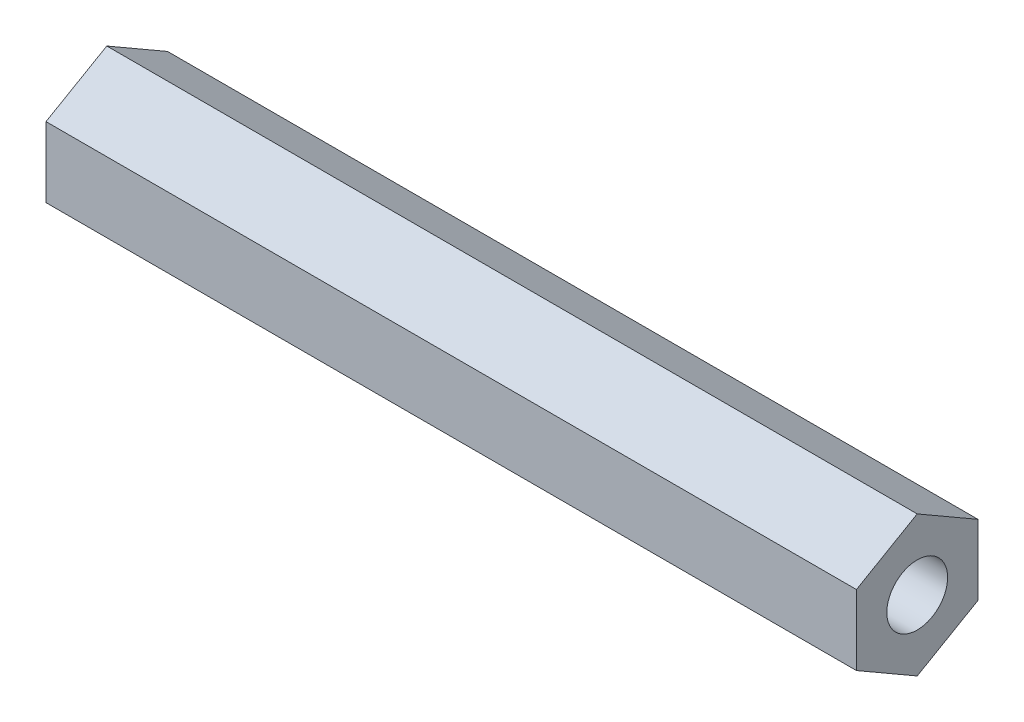
ISO-10303-21;
HEADER;
FILE_DESCRIPTION(('STEP AP214'),'2;1');
FILE_NAME('part.step','',(''),(''),'','','');
FILE_SCHEMA(('AUTOMOTIVE_DESIGN { 1 0 10303 214 1 1 1 1 }'));
ENDSEC;
DATA;
#1=APPLICATION_CONTEXT('core data for automotive mechanical design processes');
#2=APPLICATION_PROTOCOL_DEFINITION('international standard','automotive_design',2000,#1);
#3=PRODUCT_CONTEXT('',#1,'mechanical');
#4=PRODUCT('Part','Part','',(#3));
#5=PRODUCT_RELATED_PRODUCT_CATEGORY('part','',(#4));
#6=PRODUCT_DEFINITION_FORMATION('','',#4);
#7=PRODUCT_DEFINITION_CONTEXT('part definition',#1,'design');
#8=PRODUCT_DEFINITION('design','',#6,#7);
#9=PRODUCT_DEFINITION_SHAPE('','',#8);
#10=(LENGTH_UNIT() NAMED_UNIT(*) SI_UNIT(.MILLI.,.METRE.));
#11=(NAMED_UNIT(*) PLANE_ANGLE_UNIT() SI_UNIT($,.RADIAN.));
#12=(NAMED_UNIT(*) SI_UNIT($,.STERADIAN.) SOLID_ANGLE_UNIT());
#13=UNCERTAINTY_MEASURE_WITH_UNIT(LENGTH_MEASURE(1.E-05),#10,'distance_accuracy_value','');
#14=(GEOMETRIC_REPRESENTATION_CONTEXT(3) GLOBAL_UNCERTAINTY_ASSIGNED_CONTEXT((#13)) GLOBAL_UNIT_ASSIGNED_CONTEXT((#10,
#11,#12)) REPRESENTATION_CONTEXT('',''));
#15=CARTESIAN_POINT('',(0.,0.,0.));
#16=DIRECTION('',(0.,0.,1.));
#17=DIRECTION('',(1.,0.,0.));
#18=AXIS2_PLACEMENT_3D('',#15,#16,#17);
#19=CARTESIAN_POINT('',(40.,0.,0.));
#20=DIRECTION('',(1.,0.,0.));
#21=DIRECTION('',(0.,0.,-1.));
#22=AXIS2_PLACEMENT_3D('',#19,#20,#21);
#23=PLANE('',#22);
#24=DIRECTION('',(0.,0.5,0.866025403784438));
#25=VECTOR('',#24,1.);
#26=CARTESIAN_POINT('',(40.,6.54507984553655,39.7283363635929));
#27=LINE('',#26,#25);
#28=CARTESIAN_POINT('',(40.,6.54507984553655,39.7283363635929));
#29=VERTEX_POINT('',#28);
#30=CARTESIAN_POINT('',(40.,8.27713065310544,42.7283363635929));
#31=VERTEX_POINT('',#30);
#32=EDGE_CURVE('E146',#29,#31,#27,.T.);
#33=ORIENTED_EDGE('',*,*,#32,.T.);
#34=DIRECTION('',(0.,-0.500000000000001,0.866025403784438));
#35=VECTOR('',#34,1.);
#36=CARTESIAN_POINT('',(40.,8.27713065310544,42.7283363635929));
#37=LINE('',#36,#35);
#38=CARTESIAN_POINT('',(40.,6.54507984553656,45.7283363635929));
#39=VERTEX_POINT('',#38);
#40=EDGE_CURVE('E94',#31,#39,#37,.T.);
#41=ORIENTED_EDGE('',*,*,#40,.T.);
#42=DIRECTION('',(0.,-1.,0.));
#43=VECTOR('',#42,1.);
#44=CARTESIAN_POINT('',(40.,6.54507984553656,45.7283363635929));
#45=LINE('',#44,#43);
#46=CARTESIAN_POINT('',(40.,3.08097823039881,45.7283363635929));
#47=VERTEX_POINT('',#46);
#48=EDGE_CURVE('E107',#39,#47,#45,.T.);
#49=ORIENTED_EDGE('',*,*,#48,.T.);
#50=DIRECTION('',(0.,-0.5,-0.866025403784439));
#51=VECTOR('',#50,1.);
#52=CARTESIAN_POINT('',(40.,3.08097823039881,45.7283363635929));
#53=LINE('',#52,#51);
#54=CARTESIAN_POINT('',(40.,1.34892742282993,42.7283363635929));
#55=VERTEX_POINT('',#54);
#56=EDGE_CURVE('E101',#47,#55,#53,.T.);
#57=ORIENTED_EDGE('',*,*,#56,.T.);
#58=DIRECTION('',(0.,0.5,-0.866025403784439));
#59=VECTOR('',#58,1.);
#60=CARTESIAN_POINT('',(40.,1.34892742282993,42.7283363635929));
#61=LINE('',#60,#59);
#62=CARTESIAN_POINT('',(40.,3.0809782303988,39.7283363635929));
#63=VERTEX_POINT('',#62);
#64=EDGE_CURVE('E105',#55,#63,#61,.T.);
#65=ORIENTED_EDGE('',*,*,#64,.T.);
#66=DIRECTION('',(0.,1.,0.));
#67=VECTOR('',#66,1.);
#68=CARTESIAN_POINT('',(40.,3.0809782303988,39.7283363635929));
#69=LINE('',#68,#67);
#70=EDGE_CURVE('E57',#63,#29,#69,.T.);
#71=ORIENTED_EDGE('',*,*,#70,.T.);
#72=EDGE_LOOP('',(#33,#41,#49,#57,#65,#71));
#73=FACE_BOUND('',#72,.T.);
#74=CARTESIAN_POINT('',(40.,4.81302903796769,42.7283363635929));
#75=DIRECTION('',(1.,0.,0.));
#76=DIRECTION('',(0.,0.,-1.));
#77=AXIS2_PLACEMENT_3D('',#74,#75,#76);
#78=CIRCLE('',#77,1.5);
#79=CARTESIAN_POINT('',(40.,4.81302903796769,41.2283363635929));
#80=VERTEX_POINT('',#79);
#81=EDGE_CURVE('E134',#80,#80,#78,.T.);
#82=ORIENTED_EDGE('',*,*,#81,.F.);
#83=EDGE_LOOP('',(#82));
#84=FACE_BOUND('',#83,.T.);
#85=ADVANCED_FACE('F39',(#73,#84),#23,.T.);
#86=CARTESIAN_POINT('',(0.,0.,0.));
#87=DIRECTION('',(1.,0.,0.));
#88=DIRECTION('',(0.,0.,-1.));
#89=AXIS2_PLACEMENT_3D('',#86,#87,#88);
#90=PLANE('',#89);
#91=DIRECTION('',(0.,0.5,0.866025403784438));
#92=VECTOR('',#91,1.);
#93=CARTESIAN_POINT('',(0.,6.54507984553655,39.7283363635929));
#94=LINE('',#93,#92);
#95=CARTESIAN_POINT('',(0.,6.54507984553655,39.7283363635929));
#96=VERTEX_POINT('',#95);
#97=CARTESIAN_POINT('',(0.,8.27713065310544,42.7283363635929));
#98=VERTEX_POINT('',#97);
#99=EDGE_CURVE('E129',#96,#98,#94,.T.);
#100=ORIENTED_EDGE('',*,*,#99,.F.);
#101=DIRECTION('',(0.,1.,0.));
#102=VECTOR('',#101,1.);
#103=CARTESIAN_POINT('',(0.,3.0809782303988,39.7283363635929));
#104=LINE('',#103,#102);
#105=CARTESIAN_POINT('',(0.,3.0809782303988,39.7283363635929));
#106=VERTEX_POINT('',#105);
#107=EDGE_CURVE('E86',#106,#96,#104,.T.);
#108=ORIENTED_EDGE('',*,*,#107,.F.);
#109=DIRECTION('',(0.,0.5,-0.866025403784439));
#110=VECTOR('',#109,1.);
#111=CARTESIAN_POINT('',(0.,1.34892742282993,42.7283363635929));
#112=LINE('',#111,#110);
#113=CARTESIAN_POINT('',(0.,1.34892742282993,42.7283363635929));
#114=VERTEX_POINT('',#113);
#115=EDGE_CURVE('E80',#114,#106,#112,.T.);
#116=ORIENTED_EDGE('',*,*,#115,.F.);
#117=DIRECTION('',(0.,-0.5,-0.866025403784439));
#118=VECTOR('',#117,1.);
#119=CARTESIAN_POINT('',(0.,3.08097823039881,45.7283363635929));
#120=LINE('',#119,#118);
#121=CARTESIAN_POINT('',(0.,3.08097823039881,45.7283363635929));
#122=VERTEX_POINT('',#121);
#123=EDGE_CURVE('E116',#122,#114,#120,.T.);
#124=ORIENTED_EDGE('',*,*,#123,.F.);
#125=DIRECTION('',(0.,-1.,0.));
#126=VECTOR('',#125,1.);
#127=CARTESIAN_POINT('',(0.,6.54507984553656,45.7283363635929));
#128=LINE('',#127,#126);
#129=CARTESIAN_POINT('',(0.,6.54507984553656,45.7283363635929));
#130=VERTEX_POINT('',#129);
#131=EDGE_CURVE('E137',#130,#122,#128,.T.);
#132=ORIENTED_EDGE('',*,*,#131,.F.);
#133=DIRECTION('',(0.,-0.500000000000001,0.866025403784438));
#134=VECTOR('',#133,1.);
#135=CARTESIAN_POINT('',(0.,8.27713065310544,42.7283363635929));
#136=LINE('',#135,#134);
#137=EDGE_CURVE('E133',#98,#130,#136,.T.);
#138=ORIENTED_EDGE('',*,*,#137,.F.);
#139=EDGE_LOOP('',(#100,#108,#116,#124,#132,#138));
#140=FACE_BOUND('',#139,.T.);
#141=CARTESIAN_POINT('',(0.,4.81302903796769,42.7283363635929));
#142=DIRECTION('',(1.,0.,0.));
#143=DIRECTION('',(0.,0.,-1.));
#144=AXIS2_PLACEMENT_3D('',#141,#142,#143);
#145=CIRCLE('',#144,1.5);
#146=CARTESIAN_POINT('',(0.,4.81302903796769,41.2283363635929));
#147=VERTEX_POINT('',#146);
#148=EDGE_CURVE('E243',#147,#147,#145,.T.);
#149=ORIENTED_EDGE('',*,*,#148,.T.);
#150=EDGE_LOOP('',(#149));
#151=FACE_BOUND('',#150,.T.);
#152=ADVANCED_FACE('F159',(#140,#151),#90,.F.);
#153=CARTESIAN_POINT('',(40.,6.54507984553655,39.7283363635929));
#154=DIRECTION('',(0.,-0.866025403784439,0.5));
#155=DIRECTION('',(0.,-0.5,-0.866025403784439));
#156=AXIS2_PLACEMENT_3D('',#153,#154,#155);
#157=PLANE('',#156);
#158=ORIENTED_EDGE('',*,*,#99,.T.);
#159=DIRECTION('',(-1.,0.,0.));
#160=VECTOR('',#159,1.);
#161=CARTESIAN_POINT('',(40.,8.27713065310544,42.7283363635929));
#162=LINE('',#161,#160);
#163=EDGE_CURVE('E11',#31,#98,#162,.T.);
#164=ORIENTED_EDGE('',*,*,#163,.F.);
#165=ORIENTED_EDGE('',*,*,#32,.F.);
#166=DIRECTION('',(-1.,0.,0.));
#167=VECTOR('',#166,1.);
#168=CARTESIAN_POINT('',(40.,6.54507984553655,39.7283363635929));
#169=LINE('',#168,#167);
#170=EDGE_CURVE('E125',#29,#96,#169,.T.);
#171=ORIENTED_EDGE('',*,*,#170,.T.);
#172=EDGE_LOOP('',(#158,#164,#165,#171));
#173=FACE_BOUND('',#172,.T.);
#174=ADVANCED_FACE('F41',(#173),#157,.F.);
#175=CARTESIAN_POINT('',(40.,8.27713065310544,42.7283363635929));
#176=DIRECTION('',(0.,-0.866025403784438,-0.500000000000001));
#177=DIRECTION('',(0.,0.500000000000001,-0.866025403784438));
#178=AXIS2_PLACEMENT_3D('',#175,#176,#177);
#179=PLANE('',#178);
#180=ORIENTED_EDGE('',*,*,#137,.T.);
#181=DIRECTION('',(-1.,0.,0.));
#182=VECTOR('',#181,1.);
#183=CARTESIAN_POINT('',(40.,6.54507984553656,45.7283363635929));
#184=LINE('',#183,#182);
#185=EDGE_CURVE('E49',#39,#130,#184,.T.);
#186=ORIENTED_EDGE('',*,*,#185,.F.);
#187=ORIENTED_EDGE('',*,*,#40,.F.);
#188=ORIENTED_EDGE('',*,*,#163,.T.);
#189=EDGE_LOOP('',(#180,#186,#187,#188));
#190=FACE_BOUND('',#189,.T.);
#191=ADVANCED_FACE('F184',(#190),#179,.F.);
#192=CARTESIAN_POINT('',(40.,6.54507984553656,45.7283363635929));
#193=DIRECTION('',(0.,0.,-1.));
#194=DIRECTION('',(-1.,0.,0.));
#195=AXIS2_PLACEMENT_3D('',#192,#193,#194);
#196=PLANE('',#195);
#197=ORIENTED_EDGE('',*,*,#131,.T.);
#198=DIRECTION('',(-1.,0.,0.));
#199=VECTOR('',#198,1.);
#200=CARTESIAN_POINT('',(40.,3.08097823039881,45.7283363635929));
#201=LINE('',#200,#199);
#202=EDGE_CURVE('E118',#47,#122,#201,.T.);
#203=ORIENTED_EDGE('',*,*,#202,.F.);
#204=ORIENTED_EDGE('',*,*,#48,.F.);
#205=ORIENTED_EDGE('',*,*,#185,.T.);
#206=EDGE_LOOP('',(#197,#203,#204,#205));
#207=FACE_BOUND('',#206,.T.);
#208=ADVANCED_FACE('F156',(#207),#196,.F.);
#209=CARTESIAN_POINT('',(40.,3.08097823039881,45.7283363635929));
#210=DIRECTION('',(0.,0.866025403784439,-0.5));
#211=DIRECTION('',(0.,0.5,0.866025403784439));
#212=AXIS2_PLACEMENT_3D('',#209,#210,#211);
#213=PLANE('',#212);
#214=ORIENTED_EDGE('',*,*,#123,.T.);
#215=DIRECTION('',(-1.,0.,0.));
#216=VECTOR('',#215,1.);
#217=CARTESIAN_POINT('',(40.,1.34892742282993,42.7283363635929));
#218=LINE('',#217,#216);
#219=EDGE_CURVE('E113',#55,#114,#218,.T.);
#220=ORIENTED_EDGE('',*,*,#219,.F.);
#221=ORIENTED_EDGE('',*,*,#56,.F.);
#222=ORIENTED_EDGE('',*,*,#202,.T.);
#223=EDGE_LOOP('',(#214,#220,#221,#222));
#224=FACE_BOUND('',#223,.T.);
#225=ADVANCED_FACE('F114',(#224),#213,.F.);
#226=CARTESIAN_POINT('',(40.,1.34892742282993,42.7283363635929));
#227=DIRECTION('',(0.,0.866025403784439,0.5));
#228=DIRECTION('',(0.,-0.5,0.866025403784439));
#229=AXIS2_PLACEMENT_3D('',#226,#227,#228);
#230=PLANE('',#229);
#231=ORIENTED_EDGE('',*,*,#115,.T.);
#232=DIRECTION('',(-1.,0.,0.));
#233=VECTOR('',#232,1.);
#234=CARTESIAN_POINT('',(40.,3.0809782303988,39.7283363635929));
#235=LINE('',#234,#233);
#236=EDGE_CURVE('E119',#63,#106,#235,.T.);
#237=ORIENTED_EDGE('',*,*,#236,.F.);
#238=ORIENTED_EDGE('',*,*,#64,.F.);
#239=ORIENTED_EDGE('',*,*,#219,.T.);
#240=EDGE_LOOP('',(#231,#237,#238,#239));
#241=FACE_BOUND('',#240,.T.);
#242=ADVANCED_FACE('F121',(#241),#230,.F.);
#243=CARTESIAN_POINT('',(40.,3.0809782303988,39.7283363635929));
#244=DIRECTION('',(0.,0.,1.));
#245=DIRECTION('',(1.,0.,0.));
#246=AXIS2_PLACEMENT_3D('',#243,#244,#245);
#247=PLANE('',#246);
#248=ORIENTED_EDGE('',*,*,#107,.T.);
#249=ORIENTED_EDGE('',*,*,#170,.F.);
#250=ORIENTED_EDGE('',*,*,#70,.F.);
#251=ORIENTED_EDGE('',*,*,#236,.T.);
#252=EDGE_LOOP('',(#248,#249,#250,#251));
#253=FACE_BOUND('',#252,.T.);
#254=ADVANCED_FACE('F164',(#253),#247,.F.);
#255=CARTESIAN_POINT('',(40.,4.81302903796769,42.7283363635929));
#256=DIRECTION('',(-1.,0.,0.));
#257=DIRECTION('',(0.,0.,1.));
#258=AXIS2_PLACEMENT_3D('',#255,#256,#257);
#259=CYLINDRICAL_SURFACE('',#258,1.5);
#260=ORIENTED_EDGE('',*,*,#81,.T.);
#261=EDGE_LOOP('',(#260));
#262=FACE_BOUND('',#261,.T.);
#263=ORIENTED_EDGE('',*,*,#148,.F.);
#264=EDGE_LOOP('',(#263));
#265=FACE_BOUND('',#264,.T.);
#266=ADVANCED_FACE('F166',(#262,#265),#259,.F.);
#267=CLOSED_SHELL('',(#85,#152,#174,#191,#208,#225,#242,#254,#266));
#268=MANIFOLD_SOLID_BREP('B2',#267);
#269=ADVANCED_BREP_SHAPE_REPRESENTATION('',(#18,#268),#14);
#270=SHAPE_DEFINITION_REPRESENTATION(#9,#269);
ENDSEC;
END-ISO-10303-21;
